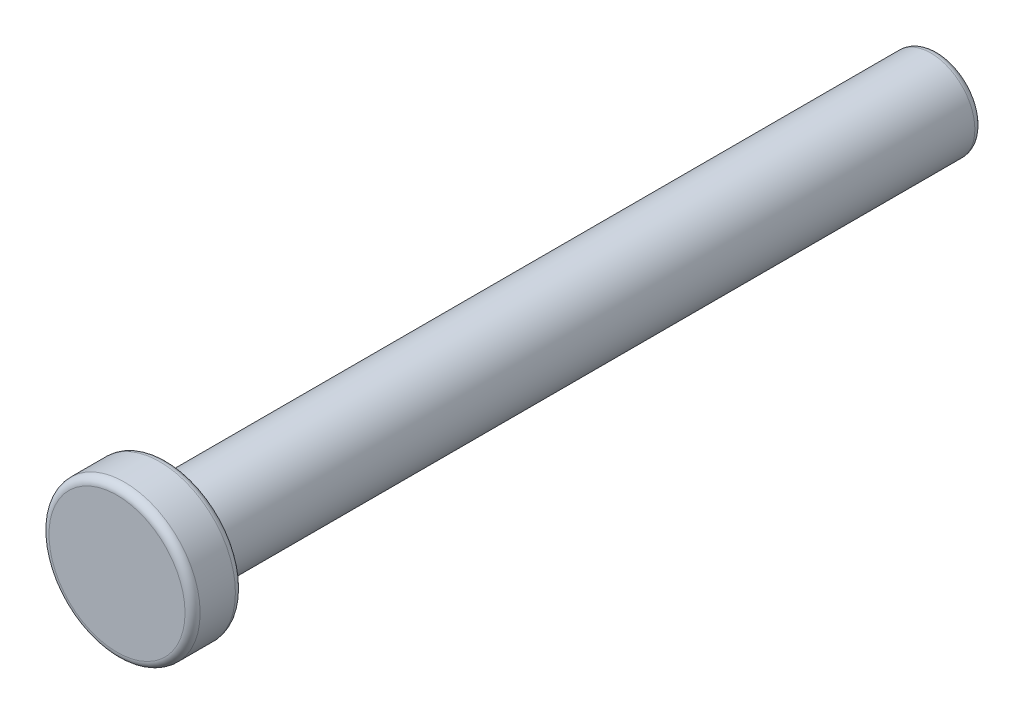
ISO-10303-21;
HEADER;
FILE_DESCRIPTION(('STEP AP214'),'2;1');
FILE_NAME('part.step','',(''),(''),'','','');
FILE_SCHEMA(('AUTOMOTIVE_DESIGN { 1 0 10303 214 1 1 1 1 }'));
ENDSEC;
DATA;
#1=APPLICATION_CONTEXT('core data for automotive mechanical design processes');
#2=APPLICATION_PROTOCOL_DEFINITION('international standard','automotive_design',2000,#1);
#3=PRODUCT_CONTEXT('',#1,'mechanical');
#4=PRODUCT('Part','Part','',(#3));
#5=PRODUCT_RELATED_PRODUCT_CATEGORY('part','',(#4));
#6=PRODUCT_DEFINITION_FORMATION('','',#4);
#7=PRODUCT_DEFINITION_CONTEXT('part definition',#1,'design');
#8=PRODUCT_DEFINITION('design','',#6,#7);
#9=PRODUCT_DEFINITION_SHAPE('','',#8);
#10=(LENGTH_UNIT() NAMED_UNIT(*) SI_UNIT(.MILLI.,.METRE.));
#11=(NAMED_UNIT(*) PLANE_ANGLE_UNIT() SI_UNIT($,.RADIAN.));
#12=(NAMED_UNIT(*) SI_UNIT($,.STERADIAN.) SOLID_ANGLE_UNIT());
#13=UNCERTAINTY_MEASURE_WITH_UNIT(LENGTH_MEASURE(1.E-05),#10,'distance_accuracy_value','');
#14=(GEOMETRIC_REPRESENTATION_CONTEXT(3) GLOBAL_UNCERTAINTY_ASSIGNED_CONTEXT((#13)) GLOBAL_UNIT_ASSIGNED_CONTEXT((#10,
#11,#12)) REPRESENTATION_CONTEXT('',''));
#15=CARTESIAN_POINT('',(0.,0.,0.));
#16=DIRECTION('',(0.,0.,1.));
#17=DIRECTION('',(1.,0.,0.));
#18=AXIS2_PLACEMENT_3D('',#15,#16,#17);
#19=CARTESIAN_POINT('',(0.,0.,2.));
#20=DIRECTION('',(0.,0.,-1.));
#21=DIRECTION('',(-1.,0.,0.));
#22=AXIS2_PLACEMENT_3D('',#19,#20,#21);
#23=CYLINDRICAL_SURFACE('',#22,3.);
#24=CARTESIAN_POINT('',(0.,0.,0.3));
#25=DIRECTION('',(0.,0.,1.));
#26=DIRECTION('',(1.,0.,0.));
#27=AXIS2_PLACEMENT_3D('',#24,#25,#26);
#28=CIRCLE('',#27,3.);
#29=CARTESIAN_POINT('',(3.,0.,0.3));
#30=VERTEX_POINT('',#29);
#31=EDGE_CURVE('E72',#30,#30,#28,.T.);
#32=ORIENTED_EDGE('',*,*,#31,.T.);
#33=EDGE_LOOP('',(#32));
#34=FACE_BOUND('',#33,.T.);
#35=CARTESIAN_POINT('',(0.,0.,1.7));
#36=DIRECTION('',(0.,0.,1.));
#37=DIRECTION('',(1.,0.,0.));
#38=AXIS2_PLACEMENT_3D('',#35,#36,#37);
#39=CIRCLE('',#38,3.);
#40=CARTESIAN_POINT('',(3.,0.,1.7));
#41=VERTEX_POINT('',#40);
#42=EDGE_CURVE('E76',#41,#41,#39,.F.);
#43=ORIENTED_EDGE('',*,*,#42,.T.);
#44=EDGE_LOOP('',(#43));
#45=FACE_BOUND('',#44,.T.);
#46=ADVANCED_FACE('F40',(#34,#45),#23,.T.);
#47=CARTESIAN_POINT('',(0.,0.,2.));
#48=DIRECTION('',(0.,0.,1.));
#49=DIRECTION('',(1.,0.,0.));
#50=AXIS2_PLACEMENT_3D('',#47,#48,#49);
#51=PLANE('',#50);
#52=CARTESIAN_POINT('',(0.,0.,2.));
#53=DIRECTION('',(0.,0.,1.));
#54=DIRECTION('',(1.,0.,0.));
#55=AXIS2_PLACEMENT_3D('',#52,#53,#54);
#56=CIRCLE('',#55,2.7);
#57=CARTESIAN_POINT('',(2.7,0.,2.));
#58=VERTEX_POINT('',#57);
#59=EDGE_CURVE('E48',#58,#58,#56,.T.);
#60=ORIENTED_EDGE('',*,*,#59,.T.);
#61=EDGE_LOOP('',(#60));
#62=FACE_BOUND('',#61,.T.);
#63=ADVANCED_FACE('F95',(#62),#51,.T.);
#64=CARTESIAN_POINT('',(0.,0.,0.));
#65=DIRECTION('',(0.,0.,1.));
#66=DIRECTION('',(1.,0.,0.));
#67=AXIS2_PLACEMENT_3D('',#64,#65,#66);
#68=PLANE('',#67);
#69=CARTESIAN_POINT('',(0.,0.,0.));
#70=DIRECTION('',(0.,0.,1.));
#71=DIRECTION('',(1.,0.,0.));
#72=AXIS2_PLACEMENT_3D('',#69,#70,#71);
#73=CIRCLE('',#72,2.7);
#74=CARTESIAN_POINT('',(2.7,0.,0.));
#75=VERTEX_POINT('',#74);
#76=EDGE_CURVE('E64',#75,#75,#73,.F.);
#77=ORIENTED_EDGE('',*,*,#76,.T.);
#78=EDGE_LOOP('',(#77));
#79=FACE_BOUND('',#78,.T.);
#80=CARTESIAN_POINT('',(0.,0.,0.));
#81=DIRECTION('',(0.,0.,1.));
#82=DIRECTION('',(1.,0.,0.));
#83=AXIS2_PLACEMENT_3D('',#80,#81,#82);
#84=CIRCLE('',#83,2.05);
#85=CARTESIAN_POINT('',(2.05,0.,0.));
#86=VERTEX_POINT('',#85);
#87=EDGE_CURVE('E68',#86,#86,#84,.T.);
#88=ORIENTED_EDGE('',*,*,#87,.T.);
#89=EDGE_LOOP('',(#88));
#90=FACE_BOUND('',#89,.T.);
#91=ADVANCED_FACE('F101',(#79,#90),#68,.F.);
#92=CARTESIAN_POINT('',(0.,0.,-30.6));
#93=DIRECTION('',(0.,0.,1.));
#94=DIRECTION('',(1.,0.,0.));
#95=AXIS2_PLACEMENT_3D('',#92,#93,#94);
#96=CYLINDRICAL_SURFACE('',#95,1.75);
#97=CARTESIAN_POINT('',(0.,0.,-0.300000000000002));
#98=DIRECTION('',(0.,0.,1.));
#99=DIRECTION('',(1.,0.,0.));
#100=AXIS2_PLACEMENT_3D('',#97,#98,#99);
#101=CIRCLE('',#100,1.75);
#102=CARTESIAN_POINT('',(1.75,0.,-0.300000000000002));
#103=VERTEX_POINT('',#102);
#104=EDGE_CURVE('E53',#103,#103,#101,.F.);
#105=ORIENTED_EDGE('',*,*,#104,.T.);
#106=EDGE_LOOP('',(#105));
#107=FACE_BOUND('',#106,.T.);
#108=CARTESIAN_POINT('',(0.,0.,-30.3));
#109=DIRECTION('',(0.,0.,1.));
#110=DIRECTION('',(1.,0.,0.));
#111=AXIS2_PLACEMENT_3D('',#108,#109,#110);
#112=CIRCLE('',#111,1.75);
#113=CARTESIAN_POINT('',(1.75,0.,-30.3));
#114=VERTEX_POINT('',#113);
#115=EDGE_CURVE('E58',#114,#114,#112,.T.);
#116=ORIENTED_EDGE('',*,*,#115,.T.);
#117=EDGE_LOOP('',(#116));
#118=FACE_BOUND('',#117,.T.);
#119=ADVANCED_FACE('F112',(#107,#118),#96,.T.);
#120=CARTESIAN_POINT('',(0.,0.,-30.6));
#121=DIRECTION('',(0.,0.,1.));
#122=DIRECTION('',(1.,0.,0.));
#123=AXIS2_PLACEMENT_3D('',#120,#121,#122);
#124=PLANE('',#123);
#125=CARTESIAN_POINT('',(0.,0.,-30.6));
#126=DIRECTION('',(0.,0.,1.));
#127=DIRECTION('',(1.,0.,0.));
#128=AXIS2_PLACEMENT_3D('',#125,#126,#127);
#129=CIRCLE('',#128,1.45);
#130=CARTESIAN_POINT('',(1.45,0.,-30.6));
#131=VERTEX_POINT('',#130);
#132=EDGE_CURVE('E10',#131,#131,#129,.F.);
#133=ORIENTED_EDGE('',*,*,#132,.T.);
#134=EDGE_LOOP('',(#133));
#135=FACE_BOUND('',#134,.T.);
#136=ADVANCED_FACE('F106',(#135),#124,.F.);
#137=CARTESIAN_POINT('',(0.,0.,0.3));
#138=DIRECTION('',(0.,0.,1.));
#139=DIRECTION('',(1.,0.,0.));
#140=AXIS2_PLACEMENT_3D('',#137,#138,#139);
#141=TOROIDAL_SURFACE('',#140,2.7,0.3);
#142=ORIENTED_EDGE('',*,*,#76,.F.);
#143=EDGE_LOOP('',(#142));
#144=FACE_BOUND('',#143,.T.);
#145=ORIENTED_EDGE('',*,*,#31,.F.);
#146=EDGE_LOOP('',(#145));
#147=FACE_BOUND('',#146,.T.);
#148=ADVANCED_FACE('F91',(#144,#147),#141,.T.);
#149=CARTESIAN_POINT('',(0.,0.,-0.300000000000002));
#150=DIRECTION('',(0.,0.,1.));
#151=DIRECTION('',(1.,0.,0.));
#152=AXIS2_PLACEMENT_3D('',#149,#150,#151);
#153=TOROIDAL_SURFACE('',#152,2.05,0.3);
#154=ORIENTED_EDGE('',*,*,#104,.F.);
#155=EDGE_LOOP('',(#154));
#156=FACE_BOUND('',#155,.T.);
#157=ORIENTED_EDGE('',*,*,#87,.F.);
#158=EDGE_LOOP('',(#157));
#159=FACE_BOUND('',#158,.T.);
#160=ADVANCED_FACE('F85',(#156,#159),#153,.F.);
#161=CARTESIAN_POINT('',(0.,0.,1.7));
#162=DIRECTION('',(0.,0.,1.));
#163=DIRECTION('',(1.,0.,0.));
#164=AXIS2_PLACEMENT_3D('',#161,#162,#163);
#165=TOROIDAL_SURFACE('',#164,2.7,0.3);
#166=ORIENTED_EDGE('',*,*,#42,.F.);
#167=EDGE_LOOP('',(#166));
#168=FACE_BOUND('',#167,.T.);
#169=ORIENTED_EDGE('',*,*,#59,.F.);
#170=EDGE_LOOP('',(#169));
#171=FACE_BOUND('',#170,.T.);
#172=ADVANCED_FACE('F82',(#168,#171),#165,.T.);
#173=CARTESIAN_POINT('',(0.,0.,-30.3));
#174=DIRECTION('',(0.,0.,1.));
#175=DIRECTION('',(1.,0.,0.));
#176=AXIS2_PLACEMENT_3D('',#173,#174,#175);
#177=TOROIDAL_SURFACE('',#176,1.45,0.3);
#178=ORIENTED_EDGE('',*,*,#132,.F.);
#179=EDGE_LOOP('',(#178));
#180=FACE_BOUND('',#179,.T.);
#181=ORIENTED_EDGE('',*,*,#115,.F.);
#182=EDGE_LOOP('',(#181));
#183=FACE_BOUND('',#182,.T.);
#184=ADVANCED_FACE('F42',(#180,#183),#177,.T.);
#185=CLOSED_SHELL('',(#46,#63,#91,#119,#136,#148,#160,#172,#184));
#186=MANIFOLD_SOLID_BREP('B2',#185);
#187=ADVANCED_BREP_SHAPE_REPRESENTATION('',(#18,#186),#14);
#188=SHAPE_DEFINITION_REPRESENTATION(#9,#187);
ENDSEC;
END-ISO-10303-21;
